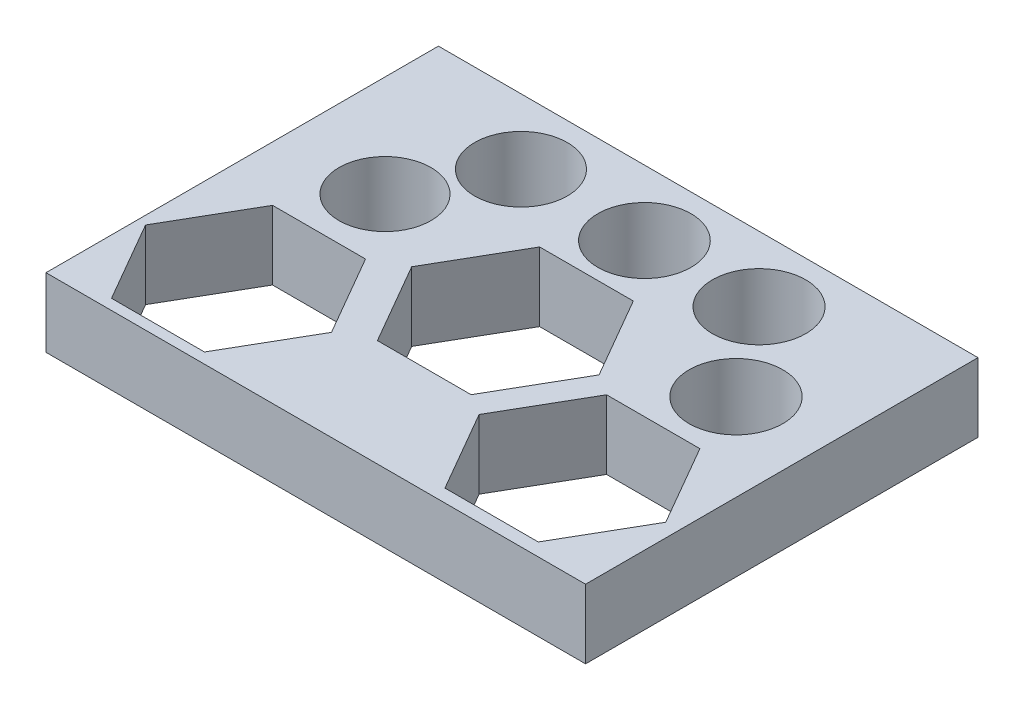
ISO-10303-21;
HEADER;
FILE_DESCRIPTION(('STEP AP214'),'2;1');
FILE_NAME('part.step','',(''),(''),'','','');
FILE_SCHEMA(('AUTOMOTIVE_DESIGN { 1 0 10303 214 1 1 1 1 }'));
ENDSEC;
DATA;
#1=APPLICATION_CONTEXT('core data for automotive mechanical design processes');
#2=APPLICATION_PROTOCOL_DEFINITION('international standard','automotive_design',2000,#1);
#3=PRODUCT_CONTEXT('',#1,'mechanical');
#4=PRODUCT('Part','Part','',(#3));
#5=PRODUCT_RELATED_PRODUCT_CATEGORY('part','',(#4));
#6=PRODUCT_DEFINITION_FORMATION('','',#4);
#7=PRODUCT_DEFINITION_CONTEXT('part definition',#1,'design');
#8=PRODUCT_DEFINITION('design','',#6,#7);
#9=PRODUCT_DEFINITION_SHAPE('','',#8);
#10=(LENGTH_UNIT() NAMED_UNIT(*) SI_UNIT(.MILLI.,.METRE.));
#11=(NAMED_UNIT(*) PLANE_ANGLE_UNIT() SI_UNIT($,.RADIAN.));
#12=(NAMED_UNIT(*) SI_UNIT($,.STERADIAN.) SOLID_ANGLE_UNIT());
#13=UNCERTAINTY_MEASURE_WITH_UNIT(LENGTH_MEASURE(1.E-05),#10,'distance_accuracy_value','');
#14=(GEOMETRIC_REPRESENTATION_CONTEXT(3) GLOBAL_UNCERTAINTY_ASSIGNED_CONTEXT((#13)) GLOBAL_UNIT_ASSIGNED_CONTEXT((#10,
#11,#12)) REPRESENTATION_CONTEXT('',''));
#15=CARTESIAN_POINT('',(0.,0.,0.));
#16=DIRECTION('',(0.,0.,1.));
#17=DIRECTION('',(1.,0.,0.));
#18=AXIS2_PLACEMENT_3D('',#15,#16,#17);
#19=CARTESIAN_POINT('',(0.,3.,0.));
#20=DIRECTION('',(0.,-1.,0.));
#21=DIRECTION('',(0.,0.,-1.));
#22=AXIS2_PLACEMENT_3D('',#19,#20,#21);
#23=PLANE('',#22);
#24=DIRECTION('',(-0.5,0.,-0.866025403784439));
#25=VECTOR('',#24,1.);
#26=CARTESIAN_POINT('',(22.8646305396023,3.,-4.07494019767622));
#27=LINE('',#26,#25);
#28=CARTESIAN_POINT('',(22.8646305396023,3.,-4.07494019767622));
#29=VERTEX_POINT('',#28);
#30=CARTESIAN_POINT('',(20.8364055396023,3.,-7.5879289468576));
#31=VERTEX_POINT('',#30);
#32=EDGE_CURVE('E258',#29,#31,#27,.T.);
#33=ORIENTED_EDGE('',*,*,#32,.F.);
#34=DIRECTION('',(0.5,0.,-0.866025403784439));
#35=VECTOR('',#34,1.);
#36=CARTESIAN_POINT('',(20.8364055396023,3.,-0.561951448494834));
#37=LINE('',#36,#35);
#38=CARTESIAN_POINT('',(20.8364055396023,3.,-0.561951448494835));
#39=VERTEX_POINT('',#38);
#40=EDGE_CURVE('E275',#39,#29,#37,.T.);
#41=ORIENTED_EDGE('',*,*,#40,.F.);
#42=DIRECTION('',(1.,0.,0.));
#43=VECTOR('',#42,1.);
#44=CARTESIAN_POINT('',(16.7799555396023,3.,-0.561951448494833));
#45=LINE('',#44,#43);
#46=CARTESIAN_POINT('',(16.7799555396023,3.,-0.561951448494833));
#47=VERTEX_POINT('',#46);
#48=EDGE_CURVE('E271',#47,#39,#45,.T.);
#49=ORIENTED_EDGE('',*,*,#48,.F.);
#50=DIRECTION('',(0.500000000000001,0.,0.866025403784438));
#51=VECTOR('',#50,1.);
#52=CARTESIAN_POINT('',(14.7517305396023,3.,-4.07494019767621));
#53=LINE('',#52,#51);
#54=CARTESIAN_POINT('',(14.7517305396023,3.,-4.07494019767621));
#55=VERTEX_POINT('',#54);
#56=EDGE_CURVE('E268',#55,#47,#53,.T.);
#57=ORIENTED_EDGE('',*,*,#56,.F.);
#58=DIRECTION('',(-0.5,0.,0.866025403784439));
#59=VECTOR('',#58,1.);
#60=CARTESIAN_POINT('',(16.7799555396023,3.,-7.5879289468576));
#61=LINE('',#60,#59);
#62=CARTESIAN_POINT('',(16.7799555396023,3.,-7.5879289468576));
#63=VERTEX_POINT('',#62);
#64=EDGE_CURVE('E265',#63,#55,#61,.T.);
#65=ORIENTED_EDGE('',*,*,#64,.F.);
#66=DIRECTION('',(-1.,0.,0.));
#67=VECTOR('',#66,1.);
#68=CARTESIAN_POINT('',(20.8364055396023,3.,-7.5879289468576));
#69=LINE('',#68,#67);
#70=EDGE_CURVE('E261',#31,#63,#69,.T.);
#71=ORIENTED_EDGE('',*,*,#70,.F.);
#72=EDGE_LOOP('',(#33,#41,#49,#57,#65,#71));
#73=FACE_BOUND('',#72,.T.);
#74=CARTESIAN_POINT('',(19.6650900719621,3.,-10.3274710931415));
#75=DIRECTION('',(0.,1.,0.));
#76=DIRECTION('',(0.,0.,1.));
#77=AXIS2_PLACEMENT_3D('',#74,#75,#76);
#78=CIRCLE('',#77,2.035);
#79=CARTESIAN_POINT('',(19.6650900719621,3.,-8.29247109314154));
#80=VERTEX_POINT('',#79);
#81=EDGE_CURVE('E384',#80,#80,#78,.T.);
#82=ORIENTED_EDGE('',*,*,#81,.F.);
#83=EDGE_LOOP('',(#82));
#84=FACE_BOUND('',#83,.T.);
#85=CARTESIAN_POINT('',(11.7961581674494,3.,-14.2168061688956));
#86=DIRECTION('',(0.,1.,0.));
#87=DIRECTION('',(0.,0.,1.));
#88=AXIS2_PLACEMENT_3D('',#85,#86,#87);
#89=CIRCLE('',#88,2.025);
#90=CARTESIAN_POINT('',(11.7961581674494,3.,-12.1918061688956));
#91=VERTEX_POINT('',#90);
#92=EDGE_CURVE('E392',#91,#91,#89,.T.);
#93=ORIENTED_EDGE('',*,*,#92,.F.);
#94=EDGE_LOOP('',(#93));
#95=FACE_BOUND('',#94,.T.);
#96=CARTESIAN_POINT('',(16.7799555396023,3.,-14.2168061688956));
#97=DIRECTION('',(0.,1.,0.));
#98=DIRECTION('',(0.,0.,1.));
#99=AXIS2_PLACEMENT_3D('',#96,#97,#98);
#100=CIRCLE('',#99,2.03);
#101=CARTESIAN_POINT('',(16.7799555396023,3.,-12.1868061688956));
#102=VERTEX_POINT('',#101);
#103=EDGE_CURVE('E400',#102,#102,#100,.T.);
#104=ORIENTED_EDGE('',*,*,#103,.F.);
#105=EDGE_LOOP('',(#104));
#106=FACE_BOUND('',#105,.T.);
#107=CARTESIAN_POINT('',(6.429732026416,3.,-14.2168061688956));
#108=DIRECTION('',(0.,1.,0.));
#109=DIRECTION('',(0.,0.,1.));
#110=AXIS2_PLACEMENT_3D('',#107,#108,#109);
#111=CIRCLE('',#110,2.015);
#112=CARTESIAN_POINT('',(6.429732026416,3.,-12.2018061688956));
#113=VERTEX_POINT('',#112);
#114=EDGE_CURVE('E408',#113,#113,#111,.T.);
#115=ORIENTED_EDGE('',*,*,#114,.F.);
#116=EDGE_LOOP('',(#115));
#117=FACE_BOUND('',#116,.T.);
#118=CARTESIAN_POINT('',(4.409007026416,3.,-10.3274710931415));
#119=DIRECTION('',(0.,1.,0.));
#120=DIRECTION('',(0.,0.,1.));
#121=AXIS2_PLACEMENT_3D('',#118,#119,#120);
#122=CIRCLE('',#121,2.);
#123=CARTESIAN_POINT('',(4.409007026416,3.,-8.32747109314154));
#124=VERTEX_POINT('',#123);
#125=EDGE_CURVE('E416',#124,#124,#122,.T.);
#126=ORIENTED_EDGE('',*,*,#125,.F.);
#127=EDGE_LOOP('',(#126));
#128=FACE_BOUND('',#127,.T.);
#129=DIRECTION('',(0.,0.,1.));
#130=VECTOR('',#129,1.);
#131=CARTESIAN_POINT('',(0.,3.,0.));
#132=LINE('',#131,#130);
#133=CARTESIAN_POINT('',(0.,3.,-17.0590125704082));
#134=VERTEX_POINT('',#133);
#135=CARTESIAN_POINT('',(0.,3.,0.));
#136=VERTEX_POINT('',#135);
#137=EDGE_CURVE('E424',#134,#136,#132,.T.);
#138=ORIENTED_EDGE('',*,*,#137,.T.);
#139=DIRECTION('',(1.,0.,0.));
#140=VECTOR('',#139,1.);
#141=CARTESIAN_POINT('',(0.,3.,0.));
#142=LINE('',#141,#140);
#143=CARTESIAN_POINT('',(23.4546986073123,3.,0.));
#144=VERTEX_POINT('',#143);
#145=EDGE_CURVE('E428',#136,#144,#142,.T.);
#146=ORIENTED_EDGE('',*,*,#145,.T.);
#147=DIRECTION('',(0.,0.,-1.));
#148=VECTOR('',#147,1.);
#149=CARTESIAN_POINT('',(23.4546986073123,3.,0.));
#150=LINE('',#149,#148);
#151=CARTESIAN_POINT('',(23.4546986073123,3.,-17.0590125704082));
#152=VERTEX_POINT('',#151);
#153=EDGE_CURVE('E432',#144,#152,#150,.T.);
#154=ORIENTED_EDGE('',*,*,#153,.T.);
#155=DIRECTION('',(-1.,0.,0.));
#156=VECTOR('',#155,1.);
#157=CARTESIAN_POINT('',(0.,3.,-17.0590125704082));
#158=LINE('',#157,#156);
#159=EDGE_CURVE('E435',#152,#134,#158,.T.);
#160=ORIENTED_EDGE('',*,*,#159,.T.);
#161=EDGE_LOOP('',(#138,#146,#154,#160));
#162=FACE_BOUND('',#161,.T.);
#163=DIRECTION('',(-0.5,0.,-0.866025403784439));
#164=VECTOR('',#163,1.);
#165=CARTESIAN_POINT('',(15.8676081674494,3.,-8.1725005962182));
#166=LINE('',#165,#164);
#167=CARTESIAN_POINT('',(15.8676081674494,3.,-8.1725005962182));
#168=VERTEX_POINT('',#167);
#169=CARTESIAN_POINT('',(13.8318831674494,3.,-11.6984797264563));
#170=VERTEX_POINT('',#169);
#171=EDGE_CURVE('E321',#168,#170,#166,.T.);
#172=ORIENTED_EDGE('',*,*,#171,.F.);
#173=DIRECTION('',(0.5,0.,-0.866025403784438));
#174=VECTOR('',#173,1.);
#175=CARTESIAN_POINT('',(13.8318831674494,3.,-4.64652146598004));
#176=LINE('',#175,#174);
#177=CARTESIAN_POINT('',(13.8318831674494,3.,-4.64652146598004));
#178=VERTEX_POINT('',#177);
#179=EDGE_CURVE('E338',#178,#168,#176,.T.);
#180=ORIENTED_EDGE('',*,*,#179,.F.);
#181=DIRECTION('',(1.,0.,0.));
#182=VECTOR('',#181,1.);
#183=CARTESIAN_POINT('',(9.76043316744943,3.,-4.64652146598004));
#184=LINE('',#183,#182);
#185=CARTESIAN_POINT('',(9.76043316744943,3.,-4.64652146598004));
#186=VERTEX_POINT('',#185);
#187=EDGE_CURVE('E334',#186,#178,#184,.T.);
#188=ORIENTED_EDGE('',*,*,#187,.F.);
#189=DIRECTION('',(0.5,0.,0.866025403784439));
#190=VECTOR('',#189,1.);
#191=CARTESIAN_POINT('',(7.72470816744943,3.,-8.1725005962182));
#192=LINE('',#191,#190);
#193=CARTESIAN_POINT('',(7.72470816744943,3.,-8.1725005962182));
#194=VERTEX_POINT('',#193);
#195=EDGE_CURVE('E331',#194,#186,#192,.T.);
#196=ORIENTED_EDGE('',*,*,#195,.F.);
#197=DIRECTION('',(-0.5,0.,0.866025403784439));
#198=VECTOR('',#197,1.);
#199=CARTESIAN_POINT('',(9.76043316744943,3.,-11.6984797264563));
#200=LINE('',#199,#198);
#201=CARTESIAN_POINT('',(9.76043316744943,3.,-11.6984797264563));
#202=VERTEX_POINT('',#201);
#203=EDGE_CURVE('E328',#202,#194,#200,.T.);
#204=ORIENTED_EDGE('',*,*,#203,.F.);
#205=DIRECTION('',(-1.,0.,0.));
#206=VECTOR('',#205,1.);
#207=CARTESIAN_POINT('',(13.8318831674494,3.,-11.6984797264563));
#208=LINE('',#207,#206);
#209=EDGE_CURVE('E324',#170,#202,#208,.T.);
#210=ORIENTED_EDGE('',*,*,#209,.F.);
#211=EDGE_LOOP('',(#172,#180,#188,#196,#204,#210));
#212=FACE_BOUND('',#211,.T.);
#213=DIRECTION('',(-0.5,0.,-0.866025403784438));
#214=VECTOR('',#213,1.);
#215=CARTESIAN_POINT('',(8.450457026416,3.,-3.95951596109757));
#216=LINE('',#215,#214);
#217=CARTESIAN_POINT('',(8.450457026416,3.,-3.95951596109757));
#218=VERTEX_POINT('',#217);
#219=CARTESIAN_POINT('',(6.429732026416,3.,-7.45951432922219));
#220=VERTEX_POINT('',#219);
#221=EDGE_CURVE('E189',#218,#220,#216,.T.);
#222=ORIENTED_EDGE('',*,*,#221,.F.);
#223=DIRECTION('',(0.5,0.,-0.866025403784438));
#224=VECTOR('',#223,1.);
#225=CARTESIAN_POINT('',(6.429732026416,3.,-0.459517592972951));
#226=LINE('',#225,#224);
#227=CARTESIAN_POINT('',(6.429732026416,3.,-0.459517592972951));
#228=VERTEX_POINT('',#227);
#229=EDGE_CURVE('E224',#228,#218,#226,.T.);
#230=ORIENTED_EDGE('',*,*,#229,.F.);
#231=DIRECTION('',(1.,0.,0.));
#232=VECTOR('',#231,1.);
#233=CARTESIAN_POINT('',(2.38828202641601,3.,-0.459517592972951));
#234=LINE('',#233,#232);
#235=CARTESIAN_POINT('',(2.38828202641601,3.,-0.459517592972951));
#236=VERTEX_POINT('',#235);
#237=EDGE_CURVE('E221',#236,#228,#234,.T.);
#238=ORIENTED_EDGE('',*,*,#237,.F.);
#239=DIRECTION('',(0.5,0.,0.866025403784438));
#240=VECTOR('',#239,1.);
#241=CARTESIAN_POINT('',(0.367557026416005,3.,-3.95951596109757));
#242=LINE('',#241,#240);
#243=CARTESIAN_POINT('',(0.367557026416005,3.,-3.95951596109757));
#244=VERTEX_POINT('',#243);
#245=EDGE_CURVE('E216',#244,#236,#242,.T.);
#246=ORIENTED_EDGE('',*,*,#245,.F.);
#247=DIRECTION('',(-0.5,0.,0.866025403784439));
#248=VECTOR('',#247,1.);
#249=CARTESIAN_POINT('',(2.38828202641601,3.,-7.45951432922219));
#250=LINE('',#249,#248);
#251=CARTESIAN_POINT('',(2.38828202641601,3.,-7.45951432922219));
#252=VERTEX_POINT('',#251);
#253=EDGE_CURVE('E212',#252,#244,#250,.T.);
#254=ORIENTED_EDGE('',*,*,#253,.F.);
#255=DIRECTION('',(-1.,0.,0.));
#256=VECTOR('',#255,1.);
#257=CARTESIAN_POINT('',(6.429732026416,3.,-7.45951432922219));
#258=LINE('',#257,#256);
#259=EDGE_CURVE('E198',#220,#252,#258,.T.);
#260=ORIENTED_EDGE('',*,*,#259,.F.);
#261=EDGE_LOOP('',(#222,#230,#238,#246,#254,#260));
#262=FACE_BOUND('',#261,.T.);
#263=ADVANCED_FACE('F39',(#73,#84,#95,#106,#117,#128,#162,#212,#262),#23,.F.);
#264=CARTESIAN_POINT('',(0.,0.,0.));
#265=DIRECTION('',(0.,-1.,0.));
#266=DIRECTION('',(0.,0.,-1.));
#267=AXIS2_PLACEMENT_3D('',#264,#265,#266);
#268=PLANE('',#267);
#269=CARTESIAN_POINT('',(11.7961581674494,0.,-14.2168061688956));
#270=DIRECTION('',(0.,1.,0.));
#271=DIRECTION('',(0.,0.,1.));
#272=AXIS2_PLACEMENT_3D('',#269,#270,#271);
#273=CIRCLE('',#272,2.025);
#274=CARTESIAN_POINT('',(11.7961581674494,0.,-12.1918061688956));
#275=VERTEX_POINT('',#274);
#276=EDGE_CURVE('E388',#275,#275,#273,.T.);
#277=ORIENTED_EDGE('',*,*,#276,.T.);
#278=EDGE_LOOP('',(#277));
#279=FACE_BOUND('',#278,.T.);
#280=CARTESIAN_POINT('',(6.429732026416,0.,-14.2168061688956));
#281=DIRECTION('',(0.,1.,0.));
#282=DIRECTION('',(0.,0.,1.));
#283=AXIS2_PLACEMENT_3D('',#280,#281,#282);
#284=CIRCLE('',#283,2.015);
#285=CARTESIAN_POINT('',(6.429732026416,0.,-12.2018061688956));
#286=VERTEX_POINT('',#285);
#287=EDGE_CURVE('E404',#286,#286,#284,.T.);
#288=ORIENTED_EDGE('',*,*,#287,.T.);
#289=EDGE_LOOP('',(#288));
#290=FACE_BOUND('',#289,.T.);
#291=DIRECTION('',(0.,0.,1.));
#292=VECTOR('',#291,1.);
#293=CARTESIAN_POINT('',(0.,0.,0.));
#294=LINE('',#293,#292);
#295=CARTESIAN_POINT('',(0.,0.,-17.0590125704082));
#296=VERTEX_POINT('',#295);
#297=CARTESIAN_POINT('',(0.,0.,0.));
#298=VERTEX_POINT('',#297);
#299=EDGE_CURVE('E420',#296,#298,#294,.T.);
#300=ORIENTED_EDGE('',*,*,#299,.F.);
#301=DIRECTION('',(-1.,0.,0.));
#302=VECTOR('',#301,1.);
#303=CARTESIAN_POINT('',(0.,0.,-17.0590125704082));
#304=LINE('',#303,#302);
#305=CARTESIAN_POINT('',(23.4546986073123,0.,-17.0590125704082));
#306=VERTEX_POINT('',#305);
#307=EDGE_CURVE('E429',#306,#296,#304,.T.);
#308=ORIENTED_EDGE('',*,*,#307,.F.);
#309=DIRECTION('',(0.,0.,-1.));
#310=VECTOR('',#309,1.);
#311=CARTESIAN_POINT('',(23.4546986073123,0.,0.));
#312=LINE('',#311,#310);
#313=CARTESIAN_POINT('',(23.4546986073123,0.,0.));
#314=VERTEX_POINT('',#313);
#315=EDGE_CURVE('E445',#314,#306,#312,.T.);
#316=ORIENTED_EDGE('',*,*,#315,.F.);
#317=DIRECTION('',(1.,0.,0.));
#318=VECTOR('',#317,1.);
#319=CARTESIAN_POINT('',(0.,0.,0.));
#320=LINE('',#319,#318);
#321=EDGE_CURVE('E442',#298,#314,#320,.T.);
#322=ORIENTED_EDGE('',*,*,#321,.F.);
#323=EDGE_LOOP('',(#300,#308,#316,#322));
#324=FACE_BOUND('',#323,.T.);
#325=CARTESIAN_POINT('',(4.409007026416,0.,-10.3274710931415));
#326=DIRECTION('',(0.,1.,0.));
#327=DIRECTION('',(0.,0.,1.));
#328=AXIS2_PLACEMENT_3D('',#325,#326,#327);
#329=CIRCLE('',#328,2.);
#330=CARTESIAN_POINT('',(4.409007026416,0.,-8.32747109314154));
#331=VERTEX_POINT('',#330);
#332=EDGE_CURVE('E412',#331,#331,#329,.T.);
#333=ORIENTED_EDGE('',*,*,#332,.T.);
#334=EDGE_LOOP('',(#333));
#335=FACE_BOUND('',#334,.T.);
#336=CARTESIAN_POINT('',(16.7799555396023,0.,-14.2168061688956));
#337=DIRECTION('',(0.,1.,0.));
#338=DIRECTION('',(0.,0.,1.));
#339=AXIS2_PLACEMENT_3D('',#336,#337,#338);
#340=CIRCLE('',#339,2.03);
#341=CARTESIAN_POINT('',(16.7799555396023,0.,-12.1868061688956));
#342=VERTEX_POINT('',#341);
#343=EDGE_CURVE('E396',#342,#342,#340,.T.);
#344=ORIENTED_EDGE('',*,*,#343,.T.);
#345=EDGE_LOOP('',(#344));
#346=FACE_BOUND('',#345,.T.);
#347=CARTESIAN_POINT('',(19.6650900719621,0.,-10.3274710931415));
#348=DIRECTION('',(0.,1.,0.));
#349=DIRECTION('',(0.,0.,1.));
#350=AXIS2_PLACEMENT_3D('',#347,#348,#349);
#351=CIRCLE('',#350,2.035);
#352=CARTESIAN_POINT('',(19.6650900719621,0.,-8.29247109314154));
#353=VERTEX_POINT('',#352);
#354=EDGE_CURVE('E383',#353,#353,#351,.T.);
#355=ORIENTED_EDGE('',*,*,#354,.T.);
#356=EDGE_LOOP('',(#355));
#357=FACE_BOUND('',#356,.T.);
#358=DIRECTION('',(0.5,0.,-0.866025403784438));
#359=VECTOR('',#358,1.);
#360=CARTESIAN_POINT('',(13.8318831674494,0.,-4.64652146598004));
#361=LINE('',#360,#359);
#362=CARTESIAN_POINT('',(13.8318831674494,0.,-4.64652146598004));
#363=VERTEX_POINT('',#362);
#364=CARTESIAN_POINT('',(15.8676081674494,0.,-8.1725005962182));
#365=VERTEX_POINT('',#364);
#366=EDGE_CURVE('E325',#363,#365,#361,.T.);
#367=ORIENTED_EDGE('',*,*,#366,.T.);
#368=DIRECTION('',(-0.5,0.,-0.866025403784439));
#369=VECTOR('',#368,1.);
#370=CARTESIAN_POINT('',(15.8676081674494,0.,-8.1725005962182));
#371=LINE('',#370,#369);
#372=CARTESIAN_POINT('',(13.8318831674494,0.,-11.6984797264563));
#373=VERTEX_POINT('',#372);
#374=EDGE_CURVE('E320',#365,#373,#371,.T.);
#375=ORIENTED_EDGE('',*,*,#374,.T.);
#376=DIRECTION('',(-1.,0.,0.));
#377=VECTOR('',#376,1.);
#378=CARTESIAN_POINT('',(13.8318831674494,0.,-11.6984797264563));
#379=LINE('',#378,#377);
#380=CARTESIAN_POINT('',(9.76043316744943,0.,-11.6984797264563));
#381=VERTEX_POINT('',#380);
#382=EDGE_CURVE('E345',#373,#381,#379,.T.);
#383=ORIENTED_EDGE('',*,*,#382,.T.);
#384=DIRECTION('',(-0.5,0.,0.866025403784439));
#385=VECTOR('',#384,1.);
#386=CARTESIAN_POINT('',(9.76043316744943,0.,-11.6984797264563));
#387=LINE('',#386,#385);
#388=CARTESIAN_POINT('',(7.72470816744943,0.,-8.1725005962182));
#389=VERTEX_POINT('',#388);
#390=EDGE_CURVE('E349',#381,#389,#387,.T.);
#391=ORIENTED_EDGE('',*,*,#390,.T.);
#392=DIRECTION('',(0.5,0.,0.866025403784439));
#393=VECTOR('',#392,1.);
#394=CARTESIAN_POINT('',(7.72470816744943,0.,-8.1725005962182));
#395=LINE('',#394,#393);
#396=CARTESIAN_POINT('',(9.76043316744943,0.,-4.64652146598004));
#397=VERTEX_POINT('',#396);
#398=EDGE_CURVE('E353',#389,#397,#395,.T.);
#399=ORIENTED_EDGE('',*,*,#398,.T.);
#400=DIRECTION('',(1.,0.,0.));
#401=VECTOR('',#400,1.);
#402=CARTESIAN_POINT('',(9.76043316744943,0.,-4.64652146598004));
#403=LINE('',#402,#401);
#404=EDGE_CURVE('E357',#397,#363,#403,.T.);
#405=ORIENTED_EDGE('',*,*,#404,.T.);
#406=EDGE_LOOP('',(#367,#375,#383,#391,#399,#405));
#407=FACE_BOUND('',#406,.T.);
#408=DIRECTION('',(0.5,0.,-0.866025403784439));
#409=VECTOR('',#408,1.);
#410=CARTESIAN_POINT('',(20.8364055396023,0.,-0.561951448494834));
#411=LINE('',#410,#409);
#412=CARTESIAN_POINT('',(20.8364055396023,0.,-0.561951448494834));
#413=VERTEX_POINT('',#412);
#414=CARTESIAN_POINT('',(22.8646305396022,0.,-4.07494019767622));
#415=VERTEX_POINT('',#414);
#416=EDGE_CURVE('E262',#413,#415,#411,.T.);
#417=ORIENTED_EDGE('',*,*,#416,.T.);
#418=DIRECTION('',(-0.5,0.,-0.866025403784439));
#419=VECTOR('',#418,1.);
#420=CARTESIAN_POINT('',(22.8646305396023,0.,-4.07494019767622));
#421=LINE('',#420,#419);
#422=CARTESIAN_POINT('',(20.8364055396023,0.,-7.5879289468576));
#423=VERTEX_POINT('',#422);
#424=EDGE_CURVE('E207',#415,#423,#421,.T.);
#425=ORIENTED_EDGE('',*,*,#424,.T.);
#426=DIRECTION('',(-1.,0.,0.));
#427=VECTOR('',#426,1.);
#428=CARTESIAN_POINT('',(20.8364055396023,0.,-7.5879289468576));
#429=LINE('',#428,#427);
#430=CARTESIAN_POINT('',(16.7799555396023,0.,-7.5879289468576));
#431=VERTEX_POINT('',#430);
#432=EDGE_CURVE('E282',#423,#431,#429,.T.);
#433=ORIENTED_EDGE('',*,*,#432,.T.);
#434=DIRECTION('',(-0.5,0.,0.866025403784439));
#435=VECTOR('',#434,1.);
#436=CARTESIAN_POINT('',(16.7799555396023,0.,-7.5879289468576));
#437=LINE('',#436,#435);
#438=CARTESIAN_POINT('',(14.7517305396023,0.,-4.07494019767621));
#439=VERTEX_POINT('',#438);
#440=EDGE_CURVE('E286',#431,#439,#437,.T.);
#441=ORIENTED_EDGE('',*,*,#440,.T.);
#442=DIRECTION('',(0.500000000000001,0.,0.866025403784438));
#443=VECTOR('',#442,1.);
#444=CARTESIAN_POINT('',(14.7517305396023,0.,-4.07494019767621));
#445=LINE('',#444,#443);
#446=CARTESIAN_POINT('',(16.7799555396023,0.,-0.561951448494833));
#447=VERTEX_POINT('',#446);
#448=EDGE_CURVE('E290',#439,#447,#445,.T.);
#449=ORIENTED_EDGE('',*,*,#448,.T.);
#450=DIRECTION('',(1.,0.,0.));
#451=VECTOR('',#450,1.);
#452=CARTESIAN_POINT('',(16.7799555396023,0.,-0.561951448494833));
#453=LINE('',#452,#451);
#454=EDGE_CURVE('E294',#447,#413,#453,.T.);
#455=ORIENTED_EDGE('',*,*,#454,.T.);
#456=EDGE_LOOP('',(#417,#425,#433,#441,#449,#455));
#457=FACE_BOUND('',#456,.T.);
#458=DIRECTION('',(0.5,0.,-0.866025403784438));
#459=VECTOR('',#458,1.);
#460=CARTESIAN_POINT('',(6.429732026416,0.,-0.459517592972951));
#461=LINE('',#460,#459);
#462=CARTESIAN_POINT('',(6.429732026416,0.,-0.459517592972951));
#463=VERTEX_POINT('',#462);
#464=CARTESIAN_POINT('',(8.450457026416,0.,-3.95951596109757));
#465=VERTEX_POINT('',#464);
#466=EDGE_CURVE('E199',#463,#465,#461,.T.);
#467=ORIENTED_EDGE('',*,*,#466,.T.);
#468=DIRECTION('',(-0.5,0.,-0.866025403784438));
#469=VECTOR('',#468,1.);
#470=CARTESIAN_POINT('',(8.450457026416,0.,-3.95951596109757));
#471=LINE('',#470,#469);
#472=CARTESIAN_POINT('',(6.429732026416,0.,-7.45951432922219));
#473=VERTEX_POINT('',#472);
#474=EDGE_CURVE('E63',#465,#473,#471,.T.);
#475=ORIENTED_EDGE('',*,*,#474,.T.);
#476=DIRECTION('',(-1.,0.,0.));
#477=VECTOR('',#476,1.);
#478=CARTESIAN_POINT('',(6.429732026416,0.,-7.45951432922219));
#479=LINE('',#478,#477);
#480=CARTESIAN_POINT('',(2.38828202641601,0.,-7.45951432922219));
#481=VERTEX_POINT('',#480);
#482=EDGE_CURVE('E205',#473,#481,#479,.T.);
#483=ORIENTED_EDGE('',*,*,#482,.T.);
#484=DIRECTION('',(-0.5,0.,0.866025403784439));
#485=VECTOR('',#484,1.);
#486=CARTESIAN_POINT('',(2.38828202641601,0.,-7.45951432922219));
#487=LINE('',#486,#485);
#488=CARTESIAN_POINT('',(0.367557026416005,0.,-3.95951596109757));
#489=VERTEX_POINT('',#488);
#490=EDGE_CURVE('E231',#481,#489,#487,.T.);
#491=ORIENTED_EDGE('',*,*,#490,.T.);
#492=DIRECTION('',(0.5,0.,0.866025403784438));
#493=VECTOR('',#492,1.);
#494=CARTESIAN_POINT('',(0.367557026416005,0.,-3.95951596109757));
#495=LINE('',#494,#493);
#496=CARTESIAN_POINT('',(2.38828202641601,0.,-0.459517592972951));
#497=VERTEX_POINT('',#496);
#498=EDGE_CURVE('E235',#489,#497,#495,.T.);
#499=ORIENTED_EDGE('',*,*,#498,.T.);
#500=DIRECTION('',(1.,0.,0.));
#501=VECTOR('',#500,1.);
#502=CARTESIAN_POINT('',(2.38828202641601,0.,-0.459517592972951));
#503=LINE('',#502,#501);
#504=EDGE_CURVE('E239',#497,#463,#503,.T.);
#505=ORIENTED_EDGE('',*,*,#504,.T.);
#506=EDGE_LOOP('',(#467,#475,#483,#491,#499,#505));
#507=FACE_BOUND('',#506,.T.);
#508=ADVANCED_FACE('F468',(#279,#290,#324,#335,#346,#357,#407,#457,#507),#268,.T.);
#509=CARTESIAN_POINT('',(0.,3.,0.));
#510=DIRECTION('',(1.,0.,0.));
#511=DIRECTION('',(0.,0.,-1.));
#512=AXIS2_PLACEMENT_3D('',#509,#510,#511);
#513=PLANE('',#512);
#514=ORIENTED_EDGE('',*,*,#299,.T.);
#515=DIRECTION('',(0.,-1.,0.));
#516=VECTOR('',#515,1.);
#517=CARTESIAN_POINT('',(0.,3.,0.));
#518=LINE('',#517,#516);
#519=EDGE_CURVE('E11',#136,#298,#518,.T.);
#520=ORIENTED_EDGE('',*,*,#519,.F.);
#521=ORIENTED_EDGE('',*,*,#137,.F.);
#522=DIRECTION('',(0.,-1.,0.));
#523=VECTOR('',#522,1.);
#524=CARTESIAN_POINT('',(0.,3.,-17.0590125704082));
#525=LINE('',#524,#523);
#526=EDGE_CURVE('E438',#134,#296,#525,.T.);
#527=ORIENTED_EDGE('',*,*,#526,.T.);
#528=EDGE_LOOP('',(#514,#520,#521,#527));
#529=FACE_BOUND('',#528,.T.);
#530=ADVANCED_FACE('F41',(#529),#513,.F.);
#531=CARTESIAN_POINT('',(0.,3.,0.));
#532=DIRECTION('',(0.,0.,-1.));
#533=DIRECTION('',(-1.,0.,0.));
#534=AXIS2_PLACEMENT_3D('',#531,#532,#533);
#535=PLANE('',#534);
#536=ORIENTED_EDGE('',*,*,#321,.T.);
#537=DIRECTION('',(0.,-1.,0.));
#538=VECTOR('',#537,1.);
#539=CARTESIAN_POINT('',(23.4546986073123,3.,0.));
#540=LINE('',#539,#538);
#541=EDGE_CURVE('E48',#144,#314,#540,.T.);
#542=ORIENTED_EDGE('',*,*,#541,.F.);
#543=ORIENTED_EDGE('',*,*,#145,.F.);
#544=ORIENTED_EDGE('',*,*,#519,.T.);
#545=EDGE_LOOP('',(#536,#542,#543,#544));
#546=FACE_BOUND('',#545,.T.);
#547=ADVANCED_FACE('F479',(#546),#535,.F.);
#548=CARTESIAN_POINT('',(23.4546986073123,3.,0.));
#549=DIRECTION('',(-1.,0.,0.));
#550=DIRECTION('',(0.,0.,1.));
#551=AXIS2_PLACEMENT_3D('',#548,#549,#550);
#552=PLANE('',#551);
#553=ORIENTED_EDGE('',*,*,#315,.T.);
#554=DIRECTION('',(0.,-1.,0.));
#555=VECTOR('',#554,1.);
#556=CARTESIAN_POINT('',(23.4546986073123,3.,-17.0590125704082));
#557=LINE('',#556,#555);
#558=EDGE_CURVE('E453',#152,#306,#557,.T.);
#559=ORIENTED_EDGE('',*,*,#558,.F.);
#560=ORIENTED_EDGE('',*,*,#153,.F.);
#561=ORIENTED_EDGE('',*,*,#541,.T.);
#562=EDGE_LOOP('',(#553,#559,#560,#561));
#563=FACE_BOUND('',#562,.T.);
#564=ADVANCED_FACE('F462',(#563),#552,.F.);
#565=CARTESIAN_POINT('',(0.,3.,-17.0590125704082));
#566=DIRECTION('',(0.,0.,1.));
#567=DIRECTION('',(1.,0.,0.));
#568=AXIS2_PLACEMENT_3D('',#565,#566,#567);
#569=PLANE('',#568);
#570=ORIENTED_EDGE('',*,*,#307,.T.);
#571=ORIENTED_EDGE('',*,*,#526,.F.);
#572=ORIENTED_EDGE('',*,*,#159,.F.);
#573=ORIENTED_EDGE('',*,*,#558,.T.);
#574=EDGE_LOOP('',(#570,#571,#572,#573));
#575=FACE_BOUND('',#574,.T.);
#576=ADVANCED_FACE('F472',(#575),#569,.F.);
#577=CARTESIAN_POINT('',(4.409007026416,3.,-10.3274710931415));
#578=DIRECTION('',(0.,-1.,0.));
#579=DIRECTION('',(0.,0.,-1.));
#580=AXIS2_PLACEMENT_3D('',#577,#578,#579);
#581=CYLINDRICAL_SURFACE('',#580,2.);
#582=ORIENTED_EDGE('',*,*,#125,.T.);
#583=EDGE_LOOP('',(#582));
#584=FACE_BOUND('',#583,.T.);
#585=ORIENTED_EDGE('',*,*,#332,.F.);
#586=EDGE_LOOP('',(#585));
#587=FACE_BOUND('',#586,.T.);
#588=ADVANCED_FACE('F497',(#584,#587),#581,.F.);
#589=CARTESIAN_POINT('',(6.429732026416,3.,-14.2168061688956));
#590=DIRECTION('',(0.,-1.,0.));
#591=DIRECTION('',(0.,0.,-1.));
#592=AXIS2_PLACEMENT_3D('',#589,#590,#591);
#593=CYLINDRICAL_SURFACE('',#592,2.015);
#594=ORIENTED_EDGE('',*,*,#114,.T.);
#595=EDGE_LOOP('',(#594));
#596=FACE_BOUND('',#595,.T.);
#597=ORIENTED_EDGE('',*,*,#287,.F.);
#598=EDGE_LOOP('',(#597));
#599=FACE_BOUND('',#598,.T.);
#600=ADVANCED_FACE('F504',(#596,#599),#593,.F.);
#601=CARTESIAN_POINT('',(16.7799555396023,3.,-14.2168061688956));
#602=DIRECTION('',(0.,-1.,0.));
#603=DIRECTION('',(0.,0.,-1.));
#604=AXIS2_PLACEMENT_3D('',#601,#602,#603);
#605=CYLINDRICAL_SURFACE('',#604,2.03);
#606=ORIENTED_EDGE('',*,*,#103,.T.);
#607=EDGE_LOOP('',(#606));
#608=FACE_BOUND('',#607,.T.);
#609=ORIENTED_EDGE('',*,*,#343,.F.);
#610=EDGE_LOOP('',(#609));
#611=FACE_BOUND('',#610,.T.);
#612=ADVANCED_FACE('F509',(#608,#611),#605,.F.);
#613=CARTESIAN_POINT('',(11.7961581674494,3.,-14.2168061688956));
#614=DIRECTION('',(0.,-1.,0.));
#615=DIRECTION('',(0.,0.,-1.));
#616=AXIS2_PLACEMENT_3D('',#613,#614,#615);
#617=CYLINDRICAL_SURFACE('',#616,2.025);
#618=ORIENTED_EDGE('',*,*,#92,.T.);
#619=EDGE_LOOP('',(#618));
#620=FACE_BOUND('',#619,.T.);
#621=ORIENTED_EDGE('',*,*,#276,.F.);
#622=EDGE_LOOP('',(#621));
#623=FACE_BOUND('',#622,.T.);
#624=ADVANCED_FACE('F599',(#620,#623),#617,.F.);
#625=CARTESIAN_POINT('',(19.6650900719621,3.,-10.3274710931415));
#626=DIRECTION('',(0.,-1.,0.));
#627=DIRECTION('',(0.,0.,-1.));
#628=AXIS2_PLACEMENT_3D('',#625,#626,#627);
#629=CYLINDRICAL_SURFACE('',#628,2.035);
#630=ORIENTED_EDGE('',*,*,#81,.T.);
#631=EDGE_LOOP('',(#630));
#632=FACE_BOUND('',#631,.T.);
#633=ORIENTED_EDGE('',*,*,#354,.F.);
#634=EDGE_LOOP('',(#633));
#635=FACE_BOUND('',#634,.T.);
#636=ADVANCED_FACE('F595',(#632,#635),#629,.F.);
#637=CARTESIAN_POINT('',(15.8676081674494,3.,-8.1725005962182));
#638=DIRECTION('',(-0.866025403784439,0.,0.5));
#639=DIRECTION('',(0.5,0.,0.866025403784439));
#640=AXIS2_PLACEMENT_3D('',#637,#638,#639);
#641=PLANE('',#640);
#642=ORIENTED_EDGE('',*,*,#374,.F.);
#643=DIRECTION('',(0.,-1.,0.));
#644=VECTOR('',#643,1.);
#645=CARTESIAN_POINT('',(15.8676081674494,3.,-8.1725005962182));
#646=LINE('',#645,#644);
#647=EDGE_CURVE('E341',#168,#365,#646,.T.);
#648=ORIENTED_EDGE('',*,*,#647,.F.);
#649=ORIENTED_EDGE('',*,*,#171,.T.);
#650=DIRECTION('',(0.,-1.,0.));
#651=VECTOR('',#650,1.);
#652=CARTESIAN_POINT('',(13.8318831674494,3.,-11.6984797264563));
#653=LINE('',#652,#651);
#654=EDGE_CURVE('E379',#170,#373,#653,.T.);
#655=ORIENTED_EDGE('',*,*,#654,.T.);
#656=EDGE_LOOP('',(#642,#648,#649,#655));
#657=FACE_BOUND('',#656,.T.);
#658=ADVANCED_FACE('F591',(#657),#641,.T.);
#659=CARTESIAN_POINT('',(13.8318831674494,3.,-11.6984797264563));
#660=DIRECTION('',(0.,0.,1.));
#661=DIRECTION('',(1.,0.,0.));
#662=AXIS2_PLACEMENT_3D('',#659,#660,#661);
#663=PLANE('',#662);
#664=ORIENTED_EDGE('',*,*,#382,.F.);
#665=ORIENTED_EDGE('',*,*,#654,.F.);
#666=ORIENTED_EDGE('',*,*,#209,.T.);
#667=DIRECTION('',(0.,-1.,0.));
#668=VECTOR('',#667,1.);
#669=CARTESIAN_POINT('',(9.76043316744943,3.,-11.6984797264563));
#670=LINE('',#669,#668);
#671=EDGE_CURVE('E376',#202,#381,#670,.T.);
#672=ORIENTED_EDGE('',*,*,#671,.T.);
#673=EDGE_LOOP('',(#664,#665,#666,#672));
#674=FACE_BOUND('',#673,.T.);
#675=ADVANCED_FACE('F587',(#674),#663,.T.);
#676=CARTESIAN_POINT('',(9.76043316744943,3.,-11.6984797264563));
#677=DIRECTION('',(0.866025403784439,0.,0.5));
#678=DIRECTION('',(0.5,0.,-0.866025403784439));
#679=AXIS2_PLACEMENT_3D('',#676,#677,#678);
#680=PLANE('',#679);
#681=ORIENTED_EDGE('',*,*,#390,.F.);
#682=ORIENTED_EDGE('',*,*,#671,.F.);
#683=ORIENTED_EDGE('',*,*,#203,.T.);
#684=DIRECTION('',(0.,-1.,0.));
#685=VECTOR('',#684,1.);
#686=CARTESIAN_POINT('',(7.72470816744943,3.,-8.1725005962182));
#687=LINE('',#686,#685);
#688=EDGE_CURVE('E373',#194,#389,#687,.T.);
#689=ORIENTED_EDGE('',*,*,#688,.T.);
#690=EDGE_LOOP('',(#681,#682,#683,#689));
#691=FACE_BOUND('',#690,.T.);
#692=ADVANCED_FACE('F583',(#691),#680,.T.);
#693=CARTESIAN_POINT('',(7.72470816744943,3.,-8.1725005962182));
#694=DIRECTION('',(0.866025403784439,0.,-0.5));
#695=DIRECTION('',(-0.5,0.,-0.866025403784439));
#696=AXIS2_PLACEMENT_3D('',#693,#694,#695);
#697=PLANE('',#696);
#698=ORIENTED_EDGE('',*,*,#398,.F.);
#699=ORIENTED_EDGE('',*,*,#688,.F.);
#700=ORIENTED_EDGE('',*,*,#195,.T.);
#701=DIRECTION('',(0.,-1.,0.));
#702=VECTOR('',#701,1.);
#703=CARTESIAN_POINT('',(9.76043316744943,3.,-4.64652146598004));
#704=LINE('',#703,#702);
#705=EDGE_CURVE('E370',#186,#397,#704,.T.);
#706=ORIENTED_EDGE('',*,*,#705,.T.);
#707=EDGE_LOOP('',(#698,#699,#700,#706));
#708=FACE_BOUND('',#707,.T.);
#709=ADVANCED_FACE('F579',(#708),#697,.T.);
#710=CARTESIAN_POINT('',(9.76043316744943,3.,-4.64652146598004));
#711=DIRECTION('',(0.,0.,-1.));
#712=DIRECTION('',(-1.,0.,0.));
#713=AXIS2_PLACEMENT_3D('',#710,#711,#712);
#714=PLANE('',#713);
#715=ORIENTED_EDGE('',*,*,#404,.F.);
#716=ORIENTED_EDGE('',*,*,#705,.F.);
#717=ORIENTED_EDGE('',*,*,#187,.T.);
#718=DIRECTION('',(0.,-1.,0.));
#719=VECTOR('',#718,1.);
#720=CARTESIAN_POINT('',(13.8318831674494,3.,-4.64652146598004));
#721=LINE('',#720,#719);
#722=EDGE_CURVE('E367',#178,#363,#721,.T.);
#723=ORIENTED_EDGE('',*,*,#722,.T.);
#724=EDGE_LOOP('',(#715,#716,#717,#723));
#725=FACE_BOUND('',#724,.T.);
#726=ADVANCED_FACE('F575',(#725),#714,.T.);
#727=CARTESIAN_POINT('',(13.8318831674494,3.,-4.64652146598004));
#728=DIRECTION('',(-0.866025403784439,0.,-0.5));
#729=DIRECTION('',(-0.5,0.,0.866025403784439));
#730=AXIS2_PLACEMENT_3D('',#727,#728,#729);
#731=PLANE('',#730);
#732=ORIENTED_EDGE('',*,*,#366,.F.);
#733=ORIENTED_EDGE('',*,*,#722,.F.);
#734=ORIENTED_EDGE('',*,*,#179,.T.);
#735=ORIENTED_EDGE('',*,*,#647,.T.);
#736=EDGE_LOOP('',(#732,#733,#734,#735));
#737=FACE_BOUND('',#736,.T.);
#738=ADVANCED_FACE('F571',(#737),#731,.T.);
#739=CARTESIAN_POINT('',(22.8646305396023,3.,-4.07494019767622));
#740=DIRECTION('',(-0.866025403784439,0.,0.5));
#741=DIRECTION('',(0.5,0.,0.866025403784439));
#742=AXIS2_PLACEMENT_3D('',#739,#740,#741);
#743=PLANE('',#742);
#744=ORIENTED_EDGE('',*,*,#424,.F.);
#745=DIRECTION('',(0.,-1.,0.));
#746=VECTOR('',#745,1.);
#747=CARTESIAN_POINT('',(22.8646305396023,3.,-4.07494019767622));
#748=LINE('',#747,#746);
#749=EDGE_CURVE('E278',#29,#415,#748,.T.);
#750=ORIENTED_EDGE('',*,*,#749,.F.);
#751=ORIENTED_EDGE('',*,*,#32,.T.);
#752=DIRECTION('',(0.,-1.,0.));
#753=VECTOR('',#752,1.);
#754=CARTESIAN_POINT('',(20.8364055396023,3.,-7.5879289468576));
#755=LINE('',#754,#753);
#756=EDGE_CURVE('E316',#31,#423,#755,.T.);
#757=ORIENTED_EDGE('',*,*,#756,.T.);
#758=EDGE_LOOP('',(#744,#750,#751,#757));
#759=FACE_BOUND('',#758,.T.);
#760=ADVANCED_FACE('F567',(#759),#743,.T.);
#761=CARTESIAN_POINT('',(20.8364055396023,3.,-7.5879289468576));
#762=DIRECTION('',(0.,0.,1.));
#763=DIRECTION('',(1.,0.,0.));
#764=AXIS2_PLACEMENT_3D('',#761,#762,#763);
#765=PLANE('',#764);
#766=ORIENTED_EDGE('',*,*,#432,.F.);
#767=ORIENTED_EDGE('',*,*,#756,.F.);
#768=ORIENTED_EDGE('',*,*,#70,.T.);
#769=DIRECTION('',(0.,-1.,0.));
#770=VECTOR('',#769,1.);
#771=CARTESIAN_POINT('',(16.7799555396023,3.,-7.5879289468576));
#772=LINE('',#771,#770);
#773=EDGE_CURVE('E313',#63,#431,#772,.T.);
#774=ORIENTED_EDGE('',*,*,#773,.T.);
#775=EDGE_LOOP('',(#766,#767,#768,#774));
#776=FACE_BOUND('',#775,.T.);
#777=ADVANCED_FACE('F563',(#776),#765,.T.);
#778=CARTESIAN_POINT('',(16.7799555396023,3.,-7.5879289468576));
#779=DIRECTION('',(0.866025403784439,0.,0.5));
#780=DIRECTION('',(0.5,0.,-0.866025403784439));
#781=AXIS2_PLACEMENT_3D('',#778,#779,#780);
#782=PLANE('',#781);
#783=ORIENTED_EDGE('',*,*,#440,.F.);
#784=ORIENTED_EDGE('',*,*,#773,.F.);
#785=ORIENTED_EDGE('',*,*,#64,.T.);
#786=DIRECTION('',(0.,-1.,0.));
#787=VECTOR('',#786,1.);
#788=CARTESIAN_POINT('',(14.7517305396023,3.,-4.07494019767621));
#789=LINE('',#788,#787);
#790=EDGE_CURVE('E310',#55,#439,#789,.T.);
#791=ORIENTED_EDGE('',*,*,#790,.T.);
#792=EDGE_LOOP('',(#783,#784,#785,#791));
#793=FACE_BOUND('',#792,.T.);
#794=ADVANCED_FACE('F559',(#793),#782,.T.);
#795=CARTESIAN_POINT('',(14.7517305396023,3.,-4.07494019767621));
#796=DIRECTION('',(0.866025403784438,0.,-0.500000000000001));
#797=DIRECTION('',(-0.500000000000001,0.,-0.866025403784438));
#798=AXIS2_PLACEMENT_3D('',#795,#796,#797);
#799=PLANE('',#798);
#800=ORIENTED_EDGE('',*,*,#448,.F.);
#801=ORIENTED_EDGE('',*,*,#790,.F.);
#802=ORIENTED_EDGE('',*,*,#56,.T.);
#803=DIRECTION('',(0.,-1.,0.));
#804=VECTOR('',#803,1.);
#805=CARTESIAN_POINT('',(16.7799555396023,3.,-0.561951448494833));
#806=LINE('',#805,#804);
#807=EDGE_CURVE('E307',#47,#447,#806,.T.);
#808=ORIENTED_EDGE('',*,*,#807,.T.);
#809=EDGE_LOOP('',(#800,#801,#802,#808));
#810=FACE_BOUND('',#809,.T.);
#811=ADVANCED_FACE('F555',(#810),#799,.T.);
#812=CARTESIAN_POINT('',(16.7799555396023,3.,-0.561951448494833));
#813=DIRECTION('',(0.,0.,-1.));
#814=DIRECTION('',(-1.,0.,0.));
#815=AXIS2_PLACEMENT_3D('',#812,#813,#814);
#816=PLANE('',#815);
#817=ORIENTED_EDGE('',*,*,#454,.F.);
#818=ORIENTED_EDGE('',*,*,#807,.F.);
#819=ORIENTED_EDGE('',*,*,#48,.T.);
#820=DIRECTION('',(0.,-1.,0.));
#821=VECTOR('',#820,1.);
#822=CARTESIAN_POINT('',(20.8364055396023,3.,-0.561951448494834));
#823=LINE('',#822,#821);
#824=EDGE_CURVE('E304',#39,#413,#823,.T.);
#825=ORIENTED_EDGE('',*,*,#824,.T.);
#826=EDGE_LOOP('',(#817,#818,#819,#825));
#827=FACE_BOUND('',#826,.T.);
#828=ADVANCED_FACE('F551',(#827),#816,.T.);
#829=CARTESIAN_POINT('',(20.8364055396023,3.,-0.561951448494834));
#830=DIRECTION('',(-0.866025403784439,0.,-0.5));
#831=DIRECTION('',(-0.5,0.,0.866025403784439));
#832=AXIS2_PLACEMENT_3D('',#829,#830,#831);
#833=PLANE('',#832);
#834=ORIENTED_EDGE('',*,*,#416,.F.);
#835=ORIENTED_EDGE('',*,*,#824,.F.);
#836=ORIENTED_EDGE('',*,*,#40,.T.);
#837=ORIENTED_EDGE('',*,*,#749,.T.);
#838=EDGE_LOOP('',(#834,#835,#836,#837));
#839=FACE_BOUND('',#838,.T.);
#840=ADVANCED_FACE('F548',(#839),#833,.T.);
#841=CARTESIAN_POINT('',(8.450457026416,3.,-3.95951596109757));
#842=DIRECTION('',(-0.866025403784439,0.,0.5));
#843=DIRECTION('',(0.5,0.,0.866025403784439));
#844=AXIS2_PLACEMENT_3D('',#841,#842,#843);
#845=PLANE('',#844);
#846=ORIENTED_EDGE('',*,*,#474,.F.);
#847=DIRECTION('',(0.,-1.,0.));
#848=VECTOR('',#847,1.);
#849=CARTESIAN_POINT('',(8.450457026416,3.,-3.95951596109757));
#850=LINE('',#849,#848);
#851=EDGE_CURVE('E193',#218,#465,#850,.T.);
#852=ORIENTED_EDGE('',*,*,#851,.F.);
#853=ORIENTED_EDGE('',*,*,#221,.T.);
#854=DIRECTION('',(0.,-1.,0.));
#855=VECTOR('',#854,1.);
#856=CARTESIAN_POINT('',(6.429732026416,3.,-7.45951432922219));
#857=LINE('',#856,#855);
#858=EDGE_CURVE('E192',#220,#473,#857,.T.);
#859=ORIENTED_EDGE('',*,*,#858,.T.);
#860=EDGE_LOOP('',(#846,#852,#853,#859));
#861=FACE_BOUND('',#860,.T.);
#862=ADVANCED_FACE('F191',(#861),#845,.T.);
#863=CARTESIAN_POINT('',(6.429732026416,3.,-7.45951432922219));
#864=DIRECTION('',(0.,0.,1.));
#865=DIRECTION('',(1.,0.,0.));
#866=AXIS2_PLACEMENT_3D('',#863,#864,#865);
#867=PLANE('',#866);
#868=ORIENTED_EDGE('',*,*,#482,.F.);
#869=ORIENTED_EDGE('',*,*,#858,.F.);
#870=ORIENTED_EDGE('',*,*,#259,.T.);
#871=DIRECTION('',(0.,-1.,0.));
#872=VECTOR('',#871,1.);
#873=CARTESIAN_POINT('',(2.38828202641601,3.,-7.45951432922219));
#874=LINE('',#873,#872);
#875=EDGE_CURVE('E208',#252,#481,#874,.T.);
#876=ORIENTED_EDGE('',*,*,#875,.T.);
#877=EDGE_LOOP('',(#868,#869,#870,#876));
#878=FACE_BOUND('',#877,.T.);
#879=ADVANCED_FACE('F202',(#878),#867,.T.);
#880=CARTESIAN_POINT('',(2.38828202641601,3.,-7.45951432922219));
#881=DIRECTION('',(0.866025403784439,0.,0.5));
#882=DIRECTION('',(0.5,0.,-0.866025403784439));
#883=AXIS2_PLACEMENT_3D('',#880,#881,#882);
#884=PLANE('',#883);
#885=ORIENTED_EDGE('',*,*,#490,.F.);
#886=ORIENTED_EDGE('',*,*,#875,.F.);
#887=ORIENTED_EDGE('',*,*,#253,.T.);
#888=DIRECTION('',(0.,-1.,0.));
#889=VECTOR('',#888,1.);
#890=CARTESIAN_POINT('',(0.367557026416005,3.,-3.95951596109757));
#891=LINE('',#890,#889);
#892=EDGE_CURVE('E253',#244,#489,#891,.T.);
#893=ORIENTED_EDGE('',*,*,#892,.T.);
#894=EDGE_LOOP('',(#885,#886,#887,#893));
#895=FACE_BOUND('',#894,.T.);
#896=ADVANCED_FACE('F535',(#895),#884,.T.);
#897=CARTESIAN_POINT('',(0.367557026416005,3.,-3.95951596109757));
#898=DIRECTION('',(0.866025403784439,0.,-0.5));
#899=DIRECTION('',(-0.5,0.,-0.866025403784439));
#900=AXIS2_PLACEMENT_3D('',#897,#898,#899);
#901=PLANE('',#900);
#902=ORIENTED_EDGE('',*,*,#498,.F.);
#903=ORIENTED_EDGE('',*,*,#892,.F.);
#904=ORIENTED_EDGE('',*,*,#245,.T.);
#905=DIRECTION('',(0.,-1.,0.));
#906=VECTOR('',#905,1.);
#907=CARTESIAN_POINT('',(2.38828202641601,3.,-0.459517592972951));
#908=LINE('',#907,#906);
#909=EDGE_CURVE('E250',#236,#497,#908,.T.);
#910=ORIENTED_EDGE('',*,*,#909,.T.);
#911=EDGE_LOOP('',(#902,#903,#904,#910));
#912=FACE_BOUND('',#911,.T.);
#913=ADVANCED_FACE('F531',(#912),#901,.T.);
#914=CARTESIAN_POINT('',(2.38828202641601,3.,-0.459517592972951));
#915=DIRECTION('',(0.,0.,-1.));
#916=DIRECTION('',(-1.,0.,0.));
#917=AXIS2_PLACEMENT_3D('',#914,#915,#916);
#918=PLANE('',#917);
#919=ORIENTED_EDGE('',*,*,#504,.F.);
#920=ORIENTED_EDGE('',*,*,#909,.F.);
#921=ORIENTED_EDGE('',*,*,#237,.T.);
#922=DIRECTION('',(0.,-1.,0.));
#923=VECTOR('',#922,1.);
#924=CARTESIAN_POINT('',(6.429732026416,3.,-0.459517592972951));
#925=LINE('',#924,#923);
#926=EDGE_CURVE('E55',#228,#463,#925,.T.);
#927=ORIENTED_EDGE('',*,*,#926,.T.);
#928=EDGE_LOOP('',(#919,#920,#921,#927));
#929=FACE_BOUND('',#928,.T.);
#930=ADVANCED_FACE('F528',(#929),#918,.T.);
#931=CARTESIAN_POINT('',(6.429732026416,3.,-0.459517592972951));
#932=DIRECTION('',(-0.866025403784439,0.,-0.5));
#933=DIRECTION('',(-0.5,0.,0.866025403784439));
#934=AXIS2_PLACEMENT_3D('',#931,#932,#933);
#935=PLANE('',#934);
#936=ORIENTED_EDGE('',*,*,#466,.F.);
#937=ORIENTED_EDGE('',*,*,#926,.F.);
#938=ORIENTED_EDGE('',*,*,#229,.T.);
#939=ORIENTED_EDGE('',*,*,#851,.T.);
#940=EDGE_LOOP('',(#936,#937,#938,#939));
#941=FACE_BOUND('',#940,.T.);
#942=ADVANCED_FACE('F524',(#941),#935,.T.);
#943=CLOSED_SHELL('',(#263,#508,#530,#547,#564,#576,#588,#600,#612,#624,#636,#658,#675,#692,
#709,#726,#738,#760,#777,#794,#811,#828,#840,#862,#879,#896,#913,#930,#942));
#944=MANIFOLD_SOLID_BREP('B2',#943);
#945=ADVANCED_BREP_SHAPE_REPRESENTATION('',(#18,#944),#14);
#946=SHAPE_DEFINITION_REPRESENTATION(#9,#945);
ENDSEC;
END-ISO-10303-21;
